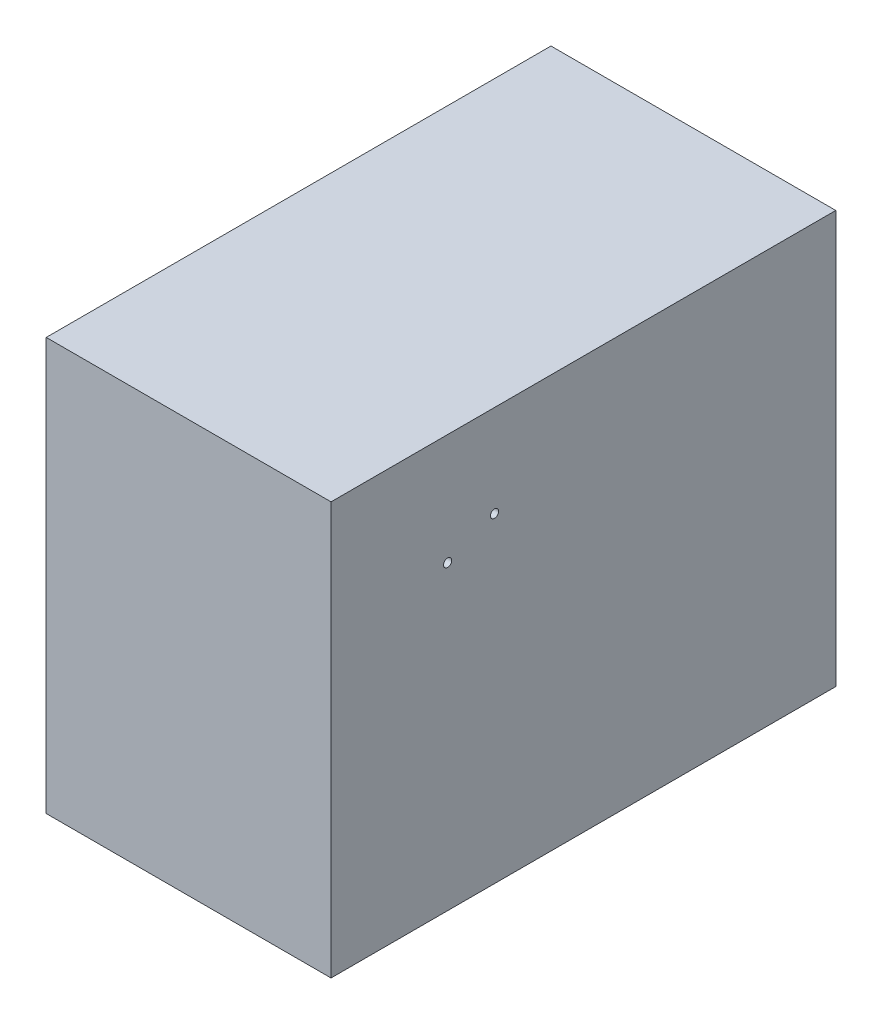
ISO-10303-21;
HEADER;
FILE_DESCRIPTION(('STEP AP214'),'2;1');
FILE_NAME('part.step','',(''),(''),'','','');
FILE_SCHEMA(('AUTOMOTIVE_DESIGN { 1 0 10303 214 1 1 1 1 }'));
ENDSEC;
DATA;
#1=APPLICATION_CONTEXT('core data for automotive mechanical design processes');
#2=APPLICATION_PROTOCOL_DEFINITION('international standard','automotive_design',2000,#1);
#3=PRODUCT_CONTEXT('',#1,'mechanical');
#4=PRODUCT('Part','Part','',(#3));
#5=PRODUCT_RELATED_PRODUCT_CATEGORY('part','',(#4));
#6=PRODUCT_DEFINITION_FORMATION('','',#4);
#7=PRODUCT_DEFINITION_CONTEXT('part definition',#1,'design');
#8=PRODUCT_DEFINITION('design','',#6,#7);
#9=PRODUCT_DEFINITION_SHAPE('','',#8);
#10=(LENGTH_UNIT() NAMED_UNIT(*) SI_UNIT(.MILLI.,.METRE.));
#11=(NAMED_UNIT(*) PLANE_ANGLE_UNIT() SI_UNIT($,.RADIAN.));
#12=(NAMED_UNIT(*) SI_UNIT($,.STERADIAN.) SOLID_ANGLE_UNIT());
#13=UNCERTAINTY_MEASURE_WITH_UNIT(LENGTH_MEASURE(1.E-05),#10,'distance_accuracy_value','');
#14=(GEOMETRIC_REPRESENTATION_CONTEXT(3) GLOBAL_UNCERTAINTY_ASSIGNED_CONTEXT((#13)) GLOBAL_UNIT_ASSIGNED_CONTEXT((#10,
#11,#12)) REPRESENTATION_CONTEXT('',''));
#15=CARTESIAN_POINT('',(0.,0.,0.));
#16=DIRECTION('',(0.,0.,1.));
#17=DIRECTION('',(1.,0.,0.));
#18=AXIS2_PLACEMENT_3D('',#15,#16,#17);
#19=CARTESIAN_POINT('',(50.165,-72.6313,177.8));
#20=DIRECTION('',(-1.,0.,0.));
#21=DIRECTION('',(0.,0.,1.));
#22=AXIS2_PLACEMENT_3D('',#19,#20,#21);
#23=PLANE('',#22);
#24=CARTESIAN_POINT('',(50.165,33.5407,136.7282));
#25=DIRECTION('',(1.,0.,0.));
#26=DIRECTION('',(0.,0.,-1.));
#27=AXIS2_PLACEMENT_3D('',#24,#25,#26);
#28=CIRCLE('',#27,1.4478);
#29=CARTESIAN_POINT('',(50.165,33.5407,135.2804));
#30=VERTEX_POINT('',#29);
#31=EDGE_CURVE('E108',#30,#30,#28,.T.);
#32=ORIENTED_EDGE('',*,*,#31,.F.);
#33=EDGE_LOOP('',(#32));
#34=FACE_BOUND('',#33,.T.);
#35=CARTESIAN_POINT('',(50.165,40.2463,120.2182));
#36=DIRECTION('',(1.,0.,0.));
#37=DIRECTION('',(0.,0.,-1.));
#38=AXIS2_PLACEMENT_3D('',#35,#36,#37);
#39=CIRCLE('',#38,1.4478);
#40=CARTESIAN_POINT('',(50.165,40.2463,118.7704));
#41=VERTEX_POINT('',#40);
#42=EDGE_CURVE('E113',#41,#41,#39,.T.);
#43=ORIENTED_EDGE('',*,*,#42,.F.);
#44=EDGE_LOOP('',(#43));
#45=FACE_BOUND('',#44,.T.);
#46=DIRECTION('',(0.,1.,0.));
#47=VECTOR('',#46,1.);
#48=CARTESIAN_POINT('',(50.165,-72.6313,0.));
#49=LINE('',#48,#47);
#50=CARTESIAN_POINT('',(50.165,-72.6313,0.));
#51=VERTEX_POINT('',#50);
#52=CARTESIAN_POINT('',(50.165,72.6313,0.));
#53=VERTEX_POINT('',#52);
#54=EDGE_CURVE('E99',#51,#53,#49,.T.);
#55=ORIENTED_EDGE('',*,*,#54,.T.);
#56=DIRECTION('',(0.,0.,-1.));
#57=VECTOR('',#56,1.);
#58=CARTESIAN_POINT('',(50.165,72.6313,177.8));
#59=LINE('',#58,#57);
#60=CARTESIAN_POINT('',(50.165,72.6313,177.8));
#61=VERTEX_POINT('',#60);
#62=EDGE_CURVE('E11',#61,#53,#59,.T.);
#63=ORIENTED_EDGE('',*,*,#62,.F.);
#64=DIRECTION('',(0.,1.,0.));
#65=VECTOR('',#64,1.);
#66=CARTESIAN_POINT('',(50.165,-72.6313,177.8));
#67=LINE('',#66,#65);
#68=CARTESIAN_POINT('',(50.165,-72.6313,177.8));
#69=VERTEX_POINT('',#68);
#70=EDGE_CURVE('E86',#69,#61,#67,.T.);
#71=ORIENTED_EDGE('',*,*,#70,.F.);
#72=DIRECTION('',(0.,0.,-1.));
#73=VECTOR('',#72,1.);
#74=CARTESIAN_POINT('',(50.165,-72.6313,177.8));
#75=LINE('',#74,#73);
#76=EDGE_CURVE('E95',#69,#51,#75,.T.);
#77=ORIENTED_EDGE('',*,*,#76,.T.);
#78=EDGE_LOOP('',(#55,#63,#71,#77));
#79=FACE_BOUND('',#78,.T.);
#80=ADVANCED_FACE('F33',(#34,#45,#79),#23,.F.);
#81=CARTESIAN_POINT('',(-50.165,72.6313,177.8));
#82=DIRECTION('',(0.,-1.,0.));
#83=DIRECTION('',(0.,0.,-1.));
#84=AXIS2_PLACEMENT_3D('',#81,#82,#83);
#85=PLANE('',#84);
#86=DIRECTION('',(-1.,0.,0.));
#87=VECTOR('',#86,1.);
#88=CARTESIAN_POINT('',(-50.165,72.6313,0.));
#89=LINE('',#88,#87);
#90=CARTESIAN_POINT('',(-50.165,72.6313,0.));
#91=VERTEX_POINT('',#90);
#92=EDGE_CURVE('E90',#53,#91,#89,.T.);
#93=ORIENTED_EDGE('',*,*,#92,.T.);
#94=DIRECTION('',(0.,0.,-1.));
#95=VECTOR('',#94,1.);
#96=CARTESIAN_POINT('',(-50.165,72.6313,177.8));
#97=LINE('',#96,#95);
#98=CARTESIAN_POINT('',(-50.165,72.6313,177.8));
#99=VERTEX_POINT('',#98);
#100=EDGE_CURVE('E42',#99,#91,#97,.T.);
#101=ORIENTED_EDGE('',*,*,#100,.F.);
#102=DIRECTION('',(-1.,0.,0.));
#103=VECTOR('',#102,1.);
#104=CARTESIAN_POINT('',(-50.165,72.6313,177.8));
#105=LINE('',#104,#103);
#106=EDGE_CURVE('E81',#61,#99,#105,.T.);
#107=ORIENTED_EDGE('',*,*,#106,.F.);
#108=ORIENTED_EDGE('',*,*,#62,.T.);
#109=EDGE_LOOP('',(#93,#101,#107,#108));
#110=FACE_BOUND('',#109,.T.);
#111=ADVANCED_FACE('F89',(#110),#85,.F.);
#112=CARTESIAN_POINT('',(-50.165,-72.6313,177.8));
#113=DIRECTION('',(1.,0.,0.));
#114=DIRECTION('',(0.,0.,-1.));
#115=AXIS2_PLACEMENT_3D('',#112,#113,#114);
#116=PLANE('',#115);
#117=CARTESIAN_POINT('',(-50.165,33.5407,136.7282));
#118=DIRECTION('',(1.,0.,0.));
#119=DIRECTION('',(0.,0.,-1.));
#120=AXIS2_PLACEMENT_3D('',#117,#118,#119);
#121=CIRCLE('',#120,1.4478);
#122=CARTESIAN_POINT('',(-50.165,33.5407,135.2804));
#123=VERTEX_POINT('',#122);
#124=EDGE_CURVE('E36',#123,#123,#121,.T.);
#125=ORIENTED_EDGE('',*,*,#124,.T.);
#126=EDGE_LOOP('',(#125));
#127=FACE_BOUND('',#126,.T.);
#128=CARTESIAN_POINT('',(-50.165,40.2463,120.2182));
#129=DIRECTION('',(1.,0.,0.));
#130=DIRECTION('',(0.,0.,-1.));
#131=AXIS2_PLACEMENT_3D('',#128,#129,#130);
#132=CIRCLE('',#131,1.4478);
#133=CARTESIAN_POINT('',(-50.165,40.2463,118.7704));
#134=VERTEX_POINT('',#133);
#135=EDGE_CURVE('E106',#134,#134,#132,.T.);
#136=ORIENTED_EDGE('',*,*,#135,.T.);
#137=EDGE_LOOP('',(#136));
#138=FACE_BOUND('',#137,.T.);
#139=DIRECTION('',(0.,-1.,0.));
#140=VECTOR('',#139,1.);
#141=CARTESIAN_POINT('',(-50.165,-72.6313,0.));
#142=LINE('',#141,#140);
#143=CARTESIAN_POINT('',(-50.165,-72.6313,0.));
#144=VERTEX_POINT('',#143);
#145=EDGE_CURVE('E68',#91,#144,#142,.T.);
#146=ORIENTED_EDGE('',*,*,#145,.T.);
#147=DIRECTION('',(0.,0.,-1.));
#148=VECTOR('',#147,1.);
#149=CARTESIAN_POINT('',(-50.165,-72.6313,177.8));
#150=LINE('',#149,#148);
#151=CARTESIAN_POINT('',(-50.165,-72.6313,177.8));
#152=VERTEX_POINT('',#151);
#153=EDGE_CURVE('E91',#152,#144,#150,.T.);
#154=ORIENTED_EDGE('',*,*,#153,.F.);
#155=DIRECTION('',(0.,-1.,0.));
#156=VECTOR('',#155,1.);
#157=CARTESIAN_POINT('',(-50.165,-72.6313,177.8));
#158=LINE('',#157,#156);
#159=EDGE_CURVE('E84',#99,#152,#158,.T.);
#160=ORIENTED_EDGE('',*,*,#159,.F.);
#161=ORIENTED_EDGE('',*,*,#100,.T.);
#162=EDGE_LOOP('',(#146,#154,#160,#161));
#163=FACE_BOUND('',#162,.T.);
#164=ADVANCED_FACE('F93',(#127,#138,#163),#116,.F.);
#165=CARTESIAN_POINT('',(-50.165,-72.6313,177.8));
#166=DIRECTION('',(0.,1.,0.));
#167=DIRECTION('',(0.,0.,1.));
#168=AXIS2_PLACEMENT_3D('',#165,#166,#167);
#169=PLANE('',#168);
#170=DIRECTION('',(1.,0.,0.));
#171=VECTOR('',#170,1.);
#172=CARTESIAN_POINT('',(-50.165,-72.6313,0.));
#173=LINE('',#172,#171);
#174=EDGE_CURVE('E74',#144,#51,#173,.T.);
#175=ORIENTED_EDGE('',*,*,#174,.T.);
#176=ORIENTED_EDGE('',*,*,#76,.F.);
#177=DIRECTION('',(1.,0.,0.));
#178=VECTOR('',#177,1.);
#179=CARTESIAN_POINT('',(-50.165,-72.6313,177.8));
#180=LINE('',#179,#178);
#181=EDGE_CURVE('E51',#152,#69,#180,.T.);
#182=ORIENTED_EDGE('',*,*,#181,.F.);
#183=ORIENTED_EDGE('',*,*,#153,.T.);
#184=EDGE_LOOP('',(#175,#176,#182,#183));
#185=FACE_BOUND('',#184,.T.);
#186=ADVANCED_FACE('F138',(#185),#169,.F.);
#187=CARTESIAN_POINT('',(0.,0.,177.8));
#188=DIRECTION('',(0.,0.,-1.));
#189=DIRECTION('',(-1.,0.,0.));
#190=AXIS2_PLACEMENT_3D('',#187,#188,#189);
#191=PLANE('',#190);
#192=ORIENTED_EDGE('',*,*,#70,.T.);
#193=ORIENTED_EDGE('',*,*,#106,.T.);
#194=ORIENTED_EDGE('',*,*,#159,.T.);
#195=ORIENTED_EDGE('',*,*,#181,.T.);
#196=EDGE_LOOP('',(#192,#193,#194,#195));
#197=FACE_BOUND('',#196,.T.);
#198=ADVANCED_FACE('F82',(#197),#191,.F.);
#199=CARTESIAN_POINT('',(0.,0.,0.));
#200=DIRECTION('',(0.,0.,-1.));
#201=DIRECTION('',(-1.,0.,0.));
#202=AXIS2_PLACEMENT_3D('',#199,#200,#201);
#203=PLANE('',#202);
#204=ORIENTED_EDGE('',*,*,#54,.F.);
#205=ORIENTED_EDGE('',*,*,#174,.F.);
#206=ORIENTED_EDGE('',*,*,#145,.F.);
#207=ORIENTED_EDGE('',*,*,#92,.F.);
#208=EDGE_LOOP('',(#204,#205,#206,#207));
#209=FACE_BOUND('',#208,.T.);
#210=ADVANCED_FACE('F129',(#209),#203,.T.);
#211=CARTESIAN_POINT('',(-127.635,40.2463,120.2182));
#212=DIRECTION('',(1.,0.,0.));
#213=DIRECTION('',(0.,0.,-1.));
#214=AXIS2_PLACEMENT_3D('',#211,#212,#213);
#215=CYLINDRICAL_SURFACE('',#214,1.4478);
#216=ORIENTED_EDGE('',*,*,#42,.T.);
#217=EDGE_LOOP('',(#216));
#218=FACE_BOUND('',#217,.T.);
#219=ORIENTED_EDGE('',*,*,#135,.F.);
#220=EDGE_LOOP('',(#219));
#221=FACE_BOUND('',#220,.T.);
#222=ADVANCED_FACE('F121',(#218,#221),#215,.F.);
#223=CARTESIAN_POINT('',(-127.635,33.5407,136.7282));
#224=DIRECTION('',(1.,0.,0.));
#225=DIRECTION('',(0.,0.,-1.));
#226=AXIS2_PLACEMENT_3D('',#223,#224,#225);
#227=CYLINDRICAL_SURFACE('',#226,1.4478);
#228=ORIENTED_EDGE('',*,*,#31,.T.);
#229=EDGE_LOOP('',(#228));
#230=FACE_BOUND('',#229,.T.);
#231=ORIENTED_EDGE('',*,*,#124,.F.);
#232=EDGE_LOOP('',(#231));
#233=FACE_BOUND('',#232,.T.);
#234=ADVANCED_FACE('F136',(#230,#233),#227,.F.);
#235=CLOSED_SHELL('',(#80,#111,#164,#186,#198,#210,#222,#234));
#236=MANIFOLD_SOLID_BREP('B2',#235);
#237=ADVANCED_BREP_SHAPE_REPRESENTATION('',(#18,#236),#14);
#238=SHAPE_DEFINITION_REPRESENTATION(#9,#237);
ENDSEC;
END-ISO-10303-21;
